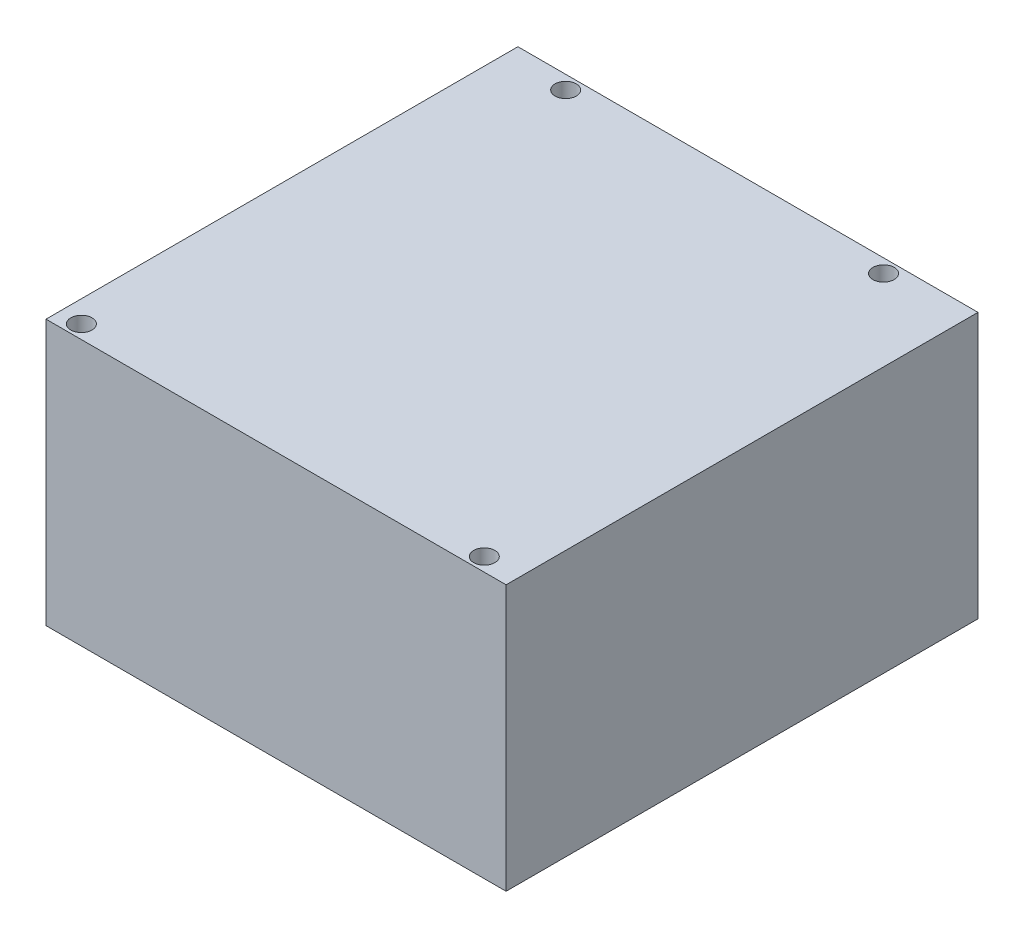
ISO-10303-21;
HEADER;
FILE_DESCRIPTION(('STEP AP214'),'2;1');
FILE_NAME('part.step','',(''),(''),'','','');
FILE_SCHEMA(('AUTOMOTIVE_DESIGN { 1 0 10303 214 1 1 1 1 }'));
ENDSEC;
DATA;
#1=APPLICATION_CONTEXT('core data for automotive mechanical design processes');
#2=APPLICATION_PROTOCOL_DEFINITION('international standard','automotive_design',2000,#1);
#3=PRODUCT_CONTEXT('',#1,'mechanical');
#4=PRODUCT('Part','Part','',(#3));
#5=PRODUCT_RELATED_PRODUCT_CATEGORY('part','',(#4));
#6=PRODUCT_DEFINITION_FORMATION('','',#4);
#7=PRODUCT_DEFINITION_CONTEXT('part definition',#1,'design');
#8=PRODUCT_DEFINITION('design','',#6,#7);
#9=PRODUCT_DEFINITION_SHAPE('','',#8);
#10=(LENGTH_UNIT() NAMED_UNIT(*) SI_UNIT(.MILLI.,.METRE.));
#11=(NAMED_UNIT(*) PLANE_ANGLE_UNIT() SI_UNIT($,.RADIAN.));
#12=(NAMED_UNIT(*) SI_UNIT($,.STERADIAN.) SOLID_ANGLE_UNIT());
#13=UNCERTAINTY_MEASURE_WITH_UNIT(LENGTH_MEASURE(1.E-05),#10,'distance_accuracy_value','');
#14=(GEOMETRIC_REPRESENTATION_CONTEXT(3) GLOBAL_UNCERTAINTY_ASSIGNED_CONTEXT((#13)) GLOBAL_UNIT_ASSIGNED_CONTEXT((#10,
#11,#12)) REPRESENTATION_CONTEXT('',''));
#15=CARTESIAN_POINT('',(0.,0.,0.));
#16=DIRECTION('',(0.,0.,1.));
#17=DIRECTION('',(1.,0.,0.));
#18=AXIS2_PLACEMENT_3D('',#15,#16,#17);
#19=CARTESIAN_POINT('',(0.,45.,0.));
#20=DIRECTION('',(0.,-1.,0.));
#21=DIRECTION('',(0.,0.,-1.));
#22=AXIS2_PLACEMENT_3D('',#19,#20,#21);
#23=PLANE('',#22);
#24=CARTESIAN_POINT('',(10.4,45.,-77.7));
#25=DIRECTION('',(0.,1.,0.));
#26=DIRECTION('',(0.,0.,1.));
#27=AXIS2_PLACEMENT_3D('',#24,#25,#26);
#28=CIRCLE('',#27,1.79999999999999);
#29=CARTESIAN_POINT('',(10.4,45.,-75.9));
#30=VERTEX_POINT('',#29);
#31=EDGE_CURVE('E130',#30,#30,#28,.T.);
#32=ORIENTED_EDGE('',*,*,#31,.F.);
#33=EDGE_LOOP('',(#32));
#34=FACE_BOUND('',#33,.T.);
#35=CARTESIAN_POINT('',(64.29,45.,-77.7));
#36=DIRECTION('',(0.,1.,0.));
#37=DIRECTION('',(0.,0.,1.));
#38=AXIS2_PLACEMENT_3D('',#35,#36,#37);
#39=CIRCLE('',#38,1.79999999999998);
#40=CARTESIAN_POINT('',(64.29,45.,-75.9));
#41=VERTEX_POINT('',#40);
#42=EDGE_CURVE('E124',#41,#41,#39,.T.);
#43=ORIENTED_EDGE('',*,*,#42,.F.);
#44=EDGE_LOOP('',(#43));
#45=FACE_BOUND('',#44,.T.);
#46=CARTESIAN_POINT('',(3.7,45.,-2.3));
#47=DIRECTION('',(0.,1.,0.));
#48=DIRECTION('',(0.,0.,1.));
#49=AXIS2_PLACEMENT_3D('',#46,#47,#48);
#50=CIRCLE('',#49,1.79999999999999);
#51=CARTESIAN_POINT('',(3.7,45.,-0.500000000000009));
#52=VERTEX_POINT('',#51);
#53=EDGE_CURVE('E112',#52,#52,#50,.T.);
#54=ORIENTED_EDGE('',*,*,#53,.F.);
#55=EDGE_LOOP('',(#54));
#56=FACE_BOUND('',#55,.T.);
#57=DIRECTION('',(0.,0.,1.));
#58=VECTOR('',#57,1.);
#59=CARTESIAN_POINT('',(0.,45.,0.));
#60=LINE('',#59,#58);
#61=CARTESIAN_POINT('',(0.,45.,-80.));
#62=VERTEX_POINT('',#61);
#63=CARTESIAN_POINT('',(0.,45.,0.));
#64=VERTEX_POINT('',#63);
#65=EDGE_CURVE('E84',#62,#64,#60,.T.);
#66=ORIENTED_EDGE('',*,*,#65,.T.);
#67=DIRECTION('',(1.,0.,0.));
#68=VECTOR('',#67,1.);
#69=CARTESIAN_POINT('',(0.,45.,0.));
#70=LINE('',#69,#68);
#71=CARTESIAN_POINT('',(78.,45.,0.));
#72=VERTEX_POINT('',#71);
#73=EDGE_CURVE('E79',#64,#72,#70,.T.);
#74=ORIENTED_EDGE('',*,*,#73,.T.);
#75=DIRECTION('',(0.,0.,-1.));
#76=VECTOR('',#75,1.);
#77=CARTESIAN_POINT('',(78.,45.,0.));
#78=LINE('',#77,#76);
#79=CARTESIAN_POINT('',(78.,45.,-80.));
#80=VERTEX_POINT('',#79);
#81=EDGE_CURVE('E82',#72,#80,#78,.T.);
#82=ORIENTED_EDGE('',*,*,#81,.T.);
#83=DIRECTION('',(-1.,0.,0.));
#84=VECTOR('',#83,1.);
#85=CARTESIAN_POINT('',(0.,45.,-80.));
#86=LINE('',#85,#84);
#87=EDGE_CURVE('E49',#80,#62,#86,.T.);
#88=ORIENTED_EDGE('',*,*,#87,.T.);
#89=EDGE_LOOP('',(#66,#74,#82,#88));
#90=FACE_BOUND('',#89,.T.);
#91=CARTESIAN_POINT('',(72.,45.,-2.3));
#92=DIRECTION('',(0.,1.,0.));
#93=DIRECTION('',(0.,0.,1.));
#94=AXIS2_PLACEMENT_3D('',#91,#92,#93);
#95=CIRCLE('',#94,1.79999999999998);
#96=CARTESIAN_POINT('',(72.,45.,-0.500000000000014));
#97=VERTEX_POINT('',#96);
#98=EDGE_CURVE('E118',#97,#97,#95,.T.);
#99=ORIENTED_EDGE('',*,*,#98,.F.);
#100=EDGE_LOOP('',(#99));
#101=FACE_BOUND('',#100,.T.);
#102=ADVANCED_FACE('F32',(#34,#45,#56,#90,#101),#23,.F.);
#103=CARTESIAN_POINT('',(0.,45.,0.));
#104=DIRECTION('',(1.,0.,0.));
#105=DIRECTION('',(0.,0.,-1.));
#106=AXIS2_PLACEMENT_3D('',#103,#104,#105);
#107=PLANE('',#106);
#108=DIRECTION('',(0.,0.,1.));
#109=VECTOR('',#108,1.);
#110=CARTESIAN_POINT('',(0.,0.,0.));
#111=LINE('',#110,#109);
#112=CARTESIAN_POINT('',(0.,0.,-80.));
#113=VERTEX_POINT('',#112);
#114=CARTESIAN_POINT('',(0.,0.,0.));
#115=VERTEX_POINT('',#114);
#116=EDGE_CURVE('E96',#113,#115,#111,.T.);
#117=ORIENTED_EDGE('',*,*,#116,.T.);
#118=DIRECTION('',(0.,-1.,0.));
#119=VECTOR('',#118,1.);
#120=CARTESIAN_POINT('',(0.,45.,0.));
#121=LINE('',#120,#119);
#122=EDGE_CURVE('E11',#64,#115,#121,.T.);
#123=ORIENTED_EDGE('',*,*,#122,.F.);
#124=ORIENTED_EDGE('',*,*,#65,.F.);
#125=DIRECTION('',(0.,-1.,0.));
#126=VECTOR('',#125,1.);
#127=CARTESIAN_POINT('',(0.,45.,-80.));
#128=LINE('',#127,#126);
#129=EDGE_CURVE('E92',#62,#113,#128,.T.);
#130=ORIENTED_EDGE('',*,*,#129,.T.);
#131=EDGE_LOOP('',(#117,#123,#124,#130));
#132=FACE_BOUND('',#131,.T.);
#133=ADVANCED_FACE('F34',(#132),#107,.F.);
#134=CARTESIAN_POINT('',(0.,45.,0.));
#135=DIRECTION('',(0.,0.,-1.));
#136=DIRECTION('',(-1.,0.,0.));
#137=AXIS2_PLACEMENT_3D('',#134,#135,#136);
#138=PLANE('',#137);
#139=DIRECTION('',(1.,0.,0.));
#140=VECTOR('',#139,1.);
#141=CARTESIAN_POINT('',(0.,0.,0.));
#142=LINE('',#141,#140);
#143=CARTESIAN_POINT('',(78.,0.,0.));
#144=VERTEX_POINT('',#143);
#145=EDGE_CURVE('E88',#115,#144,#142,.T.);
#146=ORIENTED_EDGE('',*,*,#145,.T.);
#147=DIRECTION('',(0.,-1.,0.));
#148=VECTOR('',#147,1.);
#149=CARTESIAN_POINT('',(78.,45.,0.));
#150=LINE('',#149,#148);
#151=EDGE_CURVE('E41',#72,#144,#150,.T.);
#152=ORIENTED_EDGE('',*,*,#151,.F.);
#153=ORIENTED_EDGE('',*,*,#73,.F.);
#154=ORIENTED_EDGE('',*,*,#122,.T.);
#155=EDGE_LOOP('',(#146,#152,#153,#154));
#156=FACE_BOUND('',#155,.T.);
#157=ADVANCED_FACE('F87',(#156),#138,.F.);
#158=CARTESIAN_POINT('',(78.,45.,0.));
#159=DIRECTION('',(-1.,0.,0.));
#160=DIRECTION('',(0.,0.,1.));
#161=AXIS2_PLACEMENT_3D('',#158,#159,#160);
#162=PLANE('',#161);
#163=DIRECTION('',(0.,0.,-1.));
#164=VECTOR('',#163,1.);
#165=CARTESIAN_POINT('',(78.,0.,0.));
#166=LINE('',#165,#164);
#167=CARTESIAN_POINT('',(78.,0.,-80.));
#168=VERTEX_POINT('',#167);
#169=EDGE_CURVE('E66',#144,#168,#166,.T.);
#170=ORIENTED_EDGE('',*,*,#169,.T.);
#171=DIRECTION('',(0.,-1.,0.));
#172=VECTOR('',#171,1.);
#173=CARTESIAN_POINT('',(78.,45.,-80.));
#174=LINE('',#173,#172);
#175=EDGE_CURVE('E89',#80,#168,#174,.T.);
#176=ORIENTED_EDGE('',*,*,#175,.F.);
#177=ORIENTED_EDGE('',*,*,#81,.F.);
#178=ORIENTED_EDGE('',*,*,#151,.T.);
#179=EDGE_LOOP('',(#170,#176,#177,#178));
#180=FACE_BOUND('',#179,.T.);
#181=ADVANCED_FACE('F90',(#180),#162,.F.);
#182=CARTESIAN_POINT('',(0.,45.,-80.));
#183=DIRECTION('',(0.,0.,1.));
#184=DIRECTION('',(1.,0.,0.));
#185=AXIS2_PLACEMENT_3D('',#182,#183,#184);
#186=PLANE('',#185);
#187=DIRECTION('',(-1.,0.,0.));
#188=VECTOR('',#187,1.);
#189=CARTESIAN_POINT('',(0.,0.,-80.));
#190=LINE('',#189,#188);
#191=EDGE_CURVE('E72',#168,#113,#190,.T.);
#192=ORIENTED_EDGE('',*,*,#191,.T.);
#193=ORIENTED_EDGE('',*,*,#129,.F.);
#194=ORIENTED_EDGE('',*,*,#87,.F.);
#195=ORIENTED_EDGE('',*,*,#175,.T.);
#196=EDGE_LOOP('',(#192,#193,#194,#195));
#197=FACE_BOUND('',#196,.T.);
#198=ADVANCED_FACE('F104',(#197),#186,.F.);
#199=CARTESIAN_POINT('',(0.,0.,0.));
#200=DIRECTION('',(0.,-1.,0.));
#201=DIRECTION('',(0.,0.,-1.));
#202=AXIS2_PLACEMENT_3D('',#199,#200,#201);
#203=PLANE('',#202);
#204=CARTESIAN_POINT('',(10.4,0.,-77.7));
#205=DIRECTION('',(0.,-1.,0.));
#206=DIRECTION('',(0.,0.,-1.));
#207=AXIS2_PLACEMENT_3D('',#204,#205,#206);
#208=CIRCLE('',#207,1.79999999999999);
#209=CARTESIAN_POINT('',(10.4,0.,-79.5));
#210=VERTEX_POINT('',#209);
#211=EDGE_CURVE('E127',#210,#210,#208,.T.);
#212=ORIENTED_EDGE('',*,*,#211,.F.);
#213=EDGE_LOOP('',(#212));
#214=FACE_BOUND('',#213,.T.);
#215=CARTESIAN_POINT('',(64.29,0.,-77.7));
#216=DIRECTION('',(0.,-1.,0.));
#217=DIRECTION('',(0.,0.,-1.));
#218=AXIS2_PLACEMENT_3D('',#215,#216,#217);
#219=CIRCLE('',#218,1.79999999999999);
#220=CARTESIAN_POINT('',(64.29,0.,-79.5));
#221=VERTEX_POINT('',#220);
#222=EDGE_CURVE('E121',#221,#221,#219,.T.);
#223=ORIENTED_EDGE('',*,*,#222,.F.);
#224=EDGE_LOOP('',(#223));
#225=FACE_BOUND('',#224,.T.);
#226=CARTESIAN_POINT('',(72.,0.,-2.3));
#227=DIRECTION('',(0.,-1.,0.));
#228=DIRECTION('',(0.,0.,-1.));
#229=AXIS2_PLACEMENT_3D('',#226,#227,#228);
#230=CIRCLE('',#229,1.79999999999998);
#231=CARTESIAN_POINT('',(72.,0.,-4.09999999999998));
#232=VERTEX_POINT('',#231);
#233=EDGE_CURVE('E115',#232,#232,#230,.T.);
#234=ORIENTED_EDGE('',*,*,#233,.F.);
#235=EDGE_LOOP('',(#234));
#236=FACE_BOUND('',#235,.T.);
#237=CARTESIAN_POINT('',(3.7,0.,-2.3));
#238=DIRECTION('',(0.,-1.,0.));
#239=DIRECTION('',(0.,0.,-1.));
#240=AXIS2_PLACEMENT_3D('',#237,#238,#239);
#241=CIRCLE('',#240,1.79999999999999);
#242=CARTESIAN_POINT('',(3.7,0.,-4.09999999999998));
#243=VERTEX_POINT('',#242);
#244=EDGE_CURVE('E99',#243,#243,#241,.T.);
#245=ORIENTED_EDGE('',*,*,#244,.F.);
#246=EDGE_LOOP('',(#245));
#247=FACE_BOUND('',#246,.T.);
#248=ORIENTED_EDGE('',*,*,#116,.F.);
#249=ORIENTED_EDGE('',*,*,#191,.F.);
#250=ORIENTED_EDGE('',*,*,#169,.F.);
#251=ORIENTED_EDGE('',*,*,#145,.F.);
#252=EDGE_LOOP('',(#248,#249,#250,#251));
#253=FACE_BOUND('',#252,.T.);
#254=ADVANCED_FACE('F107',(#214,#225,#236,#247,#253),#203,.T.);
#255=CARTESIAN_POINT('',(3.7,45.,-2.3));
#256=DIRECTION('',(0.,1.,0.));
#257=DIRECTION('',(0.,0.,1.));
#258=AXIS2_PLACEMENT_3D('',#255,#256,#257);
#259=CYLINDRICAL_SURFACE('',#258,1.79999999999999);
#260=ORIENTED_EDGE('',*,*,#53,.T.);
#261=EDGE_LOOP('',(#260));
#262=FACE_BOUND('',#261,.T.);
#263=ORIENTED_EDGE('',*,*,#244,.T.);
#264=EDGE_LOOP('',(#263));
#265=FACE_BOUND('',#264,.T.);
#266=ADVANCED_FACE('F144',(#262,#265),#259,.F.);
#267=CARTESIAN_POINT('',(72.,45.,-2.3));
#268=DIRECTION('',(0.,1.,0.));
#269=DIRECTION('',(0.,0.,1.));
#270=AXIS2_PLACEMENT_3D('',#267,#268,#269);
#271=CYLINDRICAL_SURFACE('',#270,1.79999999999998);
#272=ORIENTED_EDGE('',*,*,#98,.T.);
#273=EDGE_LOOP('',(#272));
#274=FACE_BOUND('',#273,.T.);
#275=ORIENTED_EDGE('',*,*,#233,.T.);
#276=EDGE_LOOP('',(#275));
#277=FACE_BOUND('',#276,.T.);
#278=ADVANCED_FACE('F147',(#274,#277),#271,.F.);
#279=CARTESIAN_POINT('',(64.29,45.,-77.7));
#280=DIRECTION('',(0.,1.,0.));
#281=DIRECTION('',(0.,0.,1.));
#282=AXIS2_PLACEMENT_3D('',#279,#280,#281);
#283=CYLINDRICAL_SURFACE('',#282,1.79999999999999);
#284=ORIENTED_EDGE('',*,*,#42,.T.);
#285=EDGE_LOOP('',(#284));
#286=FACE_BOUND('',#285,.T.);
#287=ORIENTED_EDGE('',*,*,#222,.T.);
#288=EDGE_LOOP('',(#287));
#289=FACE_BOUND('',#288,.T.);
#290=ADVANCED_FACE('F186',(#286,#289),#283,.F.);
#291=CARTESIAN_POINT('',(10.4,45.,-77.7));
#292=DIRECTION('',(0.,1.,0.));
#293=DIRECTION('',(0.,0.,1.));
#294=AXIS2_PLACEMENT_3D('',#291,#292,#293);
#295=CYLINDRICAL_SURFACE('',#294,1.79999999999999);
#296=ORIENTED_EDGE('',*,*,#31,.T.);
#297=EDGE_LOOP('',(#296));
#298=FACE_BOUND('',#297,.T.);
#299=ORIENTED_EDGE('',*,*,#211,.T.);
#300=EDGE_LOOP('',(#299));
#301=FACE_BOUND('',#300,.T.);
#302=ADVANCED_FACE('F134',(#298,#301),#295,.F.);
#303=CLOSED_SHELL('',(#102,#133,#157,#181,#198,#254,#266,#278,#290,#302));
#304=MANIFOLD_SOLID_BREP('B2',#303);
#305=ADVANCED_BREP_SHAPE_REPRESENTATION('',(#18,#304),#14);
#306=SHAPE_DEFINITION_REPRESENTATION(#9,#305);
ENDSEC;
END-ISO-10303-21;
